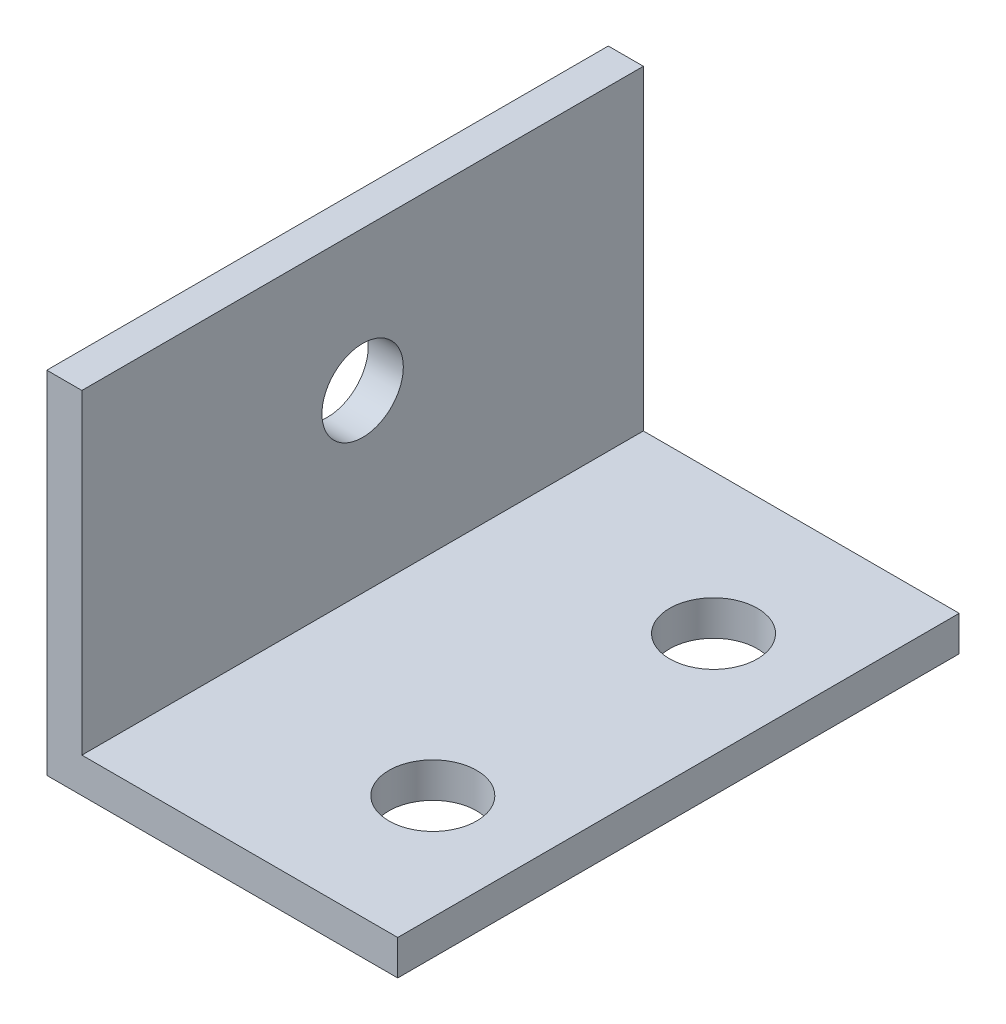
ISO-10303-21;
HEADER;
FILE_DESCRIPTION(('STEP AP214'),'2;1');
FILE_NAME('part.step','',(''),(''),'','','');
FILE_SCHEMA(('AUTOMOTIVE_DESIGN { 1 0 10303 214 1 1 1 1 }'));
ENDSEC;
DATA;
#1=APPLICATION_CONTEXT('core data for automotive mechanical design processes');
#2=APPLICATION_PROTOCOL_DEFINITION('international standard','automotive_design',2000,#1);
#3=PRODUCT_CONTEXT('',#1,'mechanical');
#4=PRODUCT('Part','Part','',(#3));
#5=PRODUCT_RELATED_PRODUCT_CATEGORY('part','',(#4));
#6=PRODUCT_DEFINITION_FORMATION('','',#4);
#7=PRODUCT_DEFINITION_CONTEXT('part definition',#1,'design');
#8=PRODUCT_DEFINITION('design','',#6,#7);
#9=PRODUCT_DEFINITION_SHAPE('','',#8);
#10=(LENGTH_UNIT() NAMED_UNIT(*) SI_UNIT(.MILLI.,.METRE.));
#11=(NAMED_UNIT(*) PLANE_ANGLE_UNIT() SI_UNIT($,.RADIAN.));
#12=(NAMED_UNIT(*) SI_UNIT($,.STERADIAN.) SOLID_ANGLE_UNIT());
#13=UNCERTAINTY_MEASURE_WITH_UNIT(LENGTH_MEASURE(1.E-05),#10,'distance_accuracy_value','');
#14=(GEOMETRIC_REPRESENTATION_CONTEXT(3) GLOBAL_UNCERTAINTY_ASSIGNED_CONTEXT((#13)) GLOBAL_UNIT_ASSIGNED_CONTEXT((#10,
#11,#12)) REPRESENTATION_CONTEXT('',''));
#15=CARTESIAN_POINT('',(0.,0.,0.));
#16=DIRECTION('',(0.,0.,1.));
#17=DIRECTION('',(1.,0.,0.));
#18=AXIS2_PLACEMENT_3D('',#15,#16,#17);
#19=CARTESIAN_POINT('',(0.,0.,50.8));
#20=DIRECTION('',(0.,1.,0.));
#21=DIRECTION('',(0.,0.,1.));
#22=AXIS2_PLACEMENT_3D('',#19,#20,#21);
#23=PLANE('',#22);
#24=CARTESIAN_POINT('',(22.225,0.,12.7));
#25=DIRECTION('',(0.,1.,0.));
#26=DIRECTION('',(0.,0.,1.));
#27=AXIS2_PLACEMENT_3D('',#24,#25,#26);
#28=CIRCLE('',#27,3.96875);
#29=CARTESIAN_POINT('',(22.225,0.,16.66875));
#30=VERTEX_POINT('',#29);
#31=EDGE_CURVE('E164',#30,#30,#28,.F.);
#32=ORIENTED_EDGE('',*,*,#31,.F.);
#33=EDGE_LOOP('',(#32));
#34=FACE_BOUND('',#33,.T.);
#35=CARTESIAN_POINT('',(22.225,0.,38.1));
#36=DIRECTION('',(0.,1.,0.));
#37=DIRECTION('',(0.,0.,1.));
#38=AXIS2_PLACEMENT_3D('',#35,#36,#37);
#39=CIRCLE('',#38,3.96875000000001);
#40=CARTESIAN_POINT('',(22.225,0.,42.06875));
#41=VERTEX_POINT('',#40);
#42=EDGE_CURVE('E167',#41,#41,#39,.F.);
#43=ORIENTED_EDGE('',*,*,#42,.F.);
#44=EDGE_LOOP('',(#43));
#45=FACE_BOUND('',#44,.T.);
#46=DIRECTION('',(1.,0.,0.));
#47=VECTOR('',#46,1.);
#48=CARTESIAN_POINT('',(0.,0.,0.));
#49=LINE('',#48,#47);
#50=CARTESIAN_POINT('',(0.,0.,0.));
#51=VERTEX_POINT('',#50);
#52=CARTESIAN_POINT('',(31.75,0.,0.));
#53=VERTEX_POINT('',#52);
#54=EDGE_CURVE('E119',#51,#53,#49,.T.);
#55=ORIENTED_EDGE('',*,*,#54,.T.);
#56=DIRECTION('',(0.,0.,-1.));
#57=VECTOR('',#56,1.);
#58=CARTESIAN_POINT('',(31.75,0.,50.8));
#59=LINE('',#58,#57);
#60=CARTESIAN_POINT('',(31.75,0.,50.8));
#61=VERTEX_POINT('',#60);
#62=EDGE_CURVE('E11',#61,#53,#59,.T.);
#63=ORIENTED_EDGE('',*,*,#62,.F.);
#64=DIRECTION('',(1.,0.,0.));
#65=VECTOR('',#64,1.);
#66=CARTESIAN_POINT('',(0.,0.,50.8));
#67=LINE('',#66,#65);
#68=CARTESIAN_POINT('',(0.,0.,50.8));
#69=VERTEX_POINT('',#68);
#70=EDGE_CURVE('E134',#69,#61,#67,.T.);
#71=ORIENTED_EDGE('',*,*,#70,.F.);
#72=DIRECTION('',(0.,0.,-1.));
#73=VECTOR('',#72,1.);
#74=CARTESIAN_POINT('',(0.,0.,50.8));
#75=LINE('',#74,#73);
#76=EDGE_CURVE('E51',#69,#51,#75,.T.);
#77=ORIENTED_EDGE('',*,*,#76,.T.);
#78=EDGE_LOOP('',(#55,#63,#71,#77));
#79=FACE_BOUND('',#78,.T.);
#80=ADVANCED_FACE('F35',(#34,#45,#79),#23,.F.);
#81=CARTESIAN_POINT('',(31.75,0.,50.8));
#82=DIRECTION('',(-1.,0.,0.));
#83=DIRECTION('',(0.,0.,1.));
#84=AXIS2_PLACEMENT_3D('',#81,#82,#83);
#85=PLANE('',#84);
#86=DIRECTION('',(0.,1.,0.));
#87=VECTOR('',#86,1.);
#88=CARTESIAN_POINT('',(31.75,0.,0.));
#89=LINE('',#88,#87);
#90=CARTESIAN_POINT('',(31.75,3.175,0.));
#91=VERTEX_POINT('',#90);
#92=EDGE_CURVE('E121',#53,#91,#89,.T.);
#93=ORIENTED_EDGE('',*,*,#92,.T.);
#94=DIRECTION('',(0.,0.,-1.));
#95=VECTOR('',#94,1.);
#96=CARTESIAN_POINT('',(31.75,3.175,50.8));
#97=LINE('',#96,#95);
#98=CARTESIAN_POINT('',(31.75,3.175,50.8));
#99=VERTEX_POINT('',#98);
#100=EDGE_CURVE('E43',#99,#91,#97,.T.);
#101=ORIENTED_EDGE('',*,*,#100,.F.);
#102=DIRECTION('',(0.,1.,0.));
#103=VECTOR('',#102,1.);
#104=CARTESIAN_POINT('',(31.75,0.,50.8));
#105=LINE('',#104,#103);
#106=EDGE_CURVE('E83',#61,#99,#105,.T.);
#107=ORIENTED_EDGE('',*,*,#106,.F.);
#108=ORIENTED_EDGE('',*,*,#62,.T.);
#109=EDGE_LOOP('',(#93,#101,#107,#108));
#110=FACE_BOUND('',#109,.T.);
#111=ADVANCED_FACE('F140',(#110),#85,.F.);
#112=CARTESIAN_POINT('',(0.,3.175,50.8));
#113=DIRECTION('',(0.,1.,0.));
#114=DIRECTION('',(0.,0.,1.));
#115=AXIS2_PLACEMENT_3D('',#112,#113,#114);
#116=PLANE('',#115);
#117=CARTESIAN_POINT('',(22.225,3.175,12.7));
#118=DIRECTION('',(0.,1.,0.));
#119=DIRECTION('',(0.,0.,1.));
#120=AXIS2_PLACEMENT_3D('',#117,#118,#119);
#121=CIRCLE('',#120,3.96875);
#122=CARTESIAN_POINT('',(22.225,3.175,16.66875));
#123=VERTEX_POINT('',#122);
#124=EDGE_CURVE('E180',#123,#123,#121,.T.);
#125=ORIENTED_EDGE('',*,*,#124,.F.);
#126=EDGE_LOOP('',(#125));
#127=FACE_BOUND('',#126,.T.);
#128=CARTESIAN_POINT('',(22.225,3.175,38.1));
#129=DIRECTION('',(0.,1.,0.));
#130=DIRECTION('',(0.,0.,1.));
#131=AXIS2_PLACEMENT_3D('',#128,#129,#130);
#132=CIRCLE('',#131,3.96875000000001);
#133=CARTESIAN_POINT('',(22.225,3.175,42.06875));
#134=VERTEX_POINT('',#133);
#135=EDGE_CURVE('E176',#134,#134,#132,.T.);
#136=ORIENTED_EDGE('',*,*,#135,.F.);
#137=EDGE_LOOP('',(#136));
#138=FACE_BOUND('',#137,.T.);
#139=DIRECTION('',(1.,0.,0.));
#140=VECTOR('',#139,1.);
#141=CARTESIAN_POINT('',(0.,3.175,0.));
#142=LINE('',#141,#140);
#143=CARTESIAN_POINT('',(3.175,3.175,0.));
#144=VERTEX_POINT('',#143);
#145=EDGE_CURVE('E125',#144,#91,#142,.T.);
#146=ORIENTED_EDGE('',*,*,#145,.F.);
#147=DIRECTION('',(0.,0.,-1.));
#148=VECTOR('',#147,1.);
#149=CARTESIAN_POINT('',(3.175,3.175,50.8));
#150=LINE('',#149,#148);
#151=CARTESIAN_POINT('',(3.175,3.175,50.8));
#152=VERTEX_POINT('',#151);
#153=EDGE_CURVE('E111',#152,#144,#150,.T.);
#154=ORIENTED_EDGE('',*,*,#153,.F.);
#155=DIRECTION('',(1.,0.,0.));
#156=VECTOR('',#155,1.);
#157=CARTESIAN_POINT('',(0.,3.175,50.8));
#158=LINE('',#157,#156);
#159=EDGE_CURVE('E101',#152,#99,#158,.T.);
#160=ORIENTED_EDGE('',*,*,#159,.T.);
#161=ORIENTED_EDGE('',*,*,#100,.T.);
#162=EDGE_LOOP('',(#146,#154,#160,#161));
#163=FACE_BOUND('',#162,.T.);
#164=ADVANCED_FACE('F139',(#127,#138,#163),#116,.T.);
#165=CARTESIAN_POINT('',(3.175,0.,50.8));
#166=DIRECTION('',(-1.,0.,0.));
#167=DIRECTION('',(0.,0.,1.));
#168=AXIS2_PLACEMENT_3D('',#165,#166,#167);
#169=PLANE('',#168);
#170=CARTESIAN_POINT('',(3.175,19.05,25.4));
#171=DIRECTION('',(1.,0.,0.));
#172=DIRECTION('',(0.,0.,-1.));
#173=AXIS2_PLACEMENT_3D('',#170,#171,#172);
#174=CIRCLE('',#173,3.683);
#175=CARTESIAN_POINT('',(3.175,19.05,21.717));
#176=VERTEX_POINT('',#175);
#177=EDGE_CURVE('E122',#176,#176,#174,.T.);
#178=ORIENTED_EDGE('',*,*,#177,.F.);
#179=EDGE_LOOP('',(#178));
#180=FACE_BOUND('',#179,.T.);
#181=DIRECTION('',(0.,1.,0.));
#182=VECTOR('',#181,1.);
#183=CARTESIAN_POINT('',(3.175,0.,0.));
#184=LINE('',#183,#182);
#185=CARTESIAN_POINT('',(3.175,31.75,0.));
#186=VERTEX_POINT('',#185);
#187=EDGE_CURVE('E108',#144,#186,#184,.T.);
#188=ORIENTED_EDGE('',*,*,#187,.T.);
#189=DIRECTION('',(0.,0.,-1.));
#190=VECTOR('',#189,1.);
#191=CARTESIAN_POINT('',(3.175,31.75,50.8));
#192=LINE('',#191,#190);
#193=CARTESIAN_POINT('',(3.175,31.75,50.8));
#194=VERTEX_POINT('',#193);
#195=EDGE_CURVE('E105',#194,#186,#192,.T.);
#196=ORIENTED_EDGE('',*,*,#195,.F.);
#197=DIRECTION('',(0.,1.,0.));
#198=VECTOR('',#197,1.);
#199=CARTESIAN_POINT('',(3.175,0.,50.8));
#200=LINE('',#199,#198);
#201=EDGE_CURVE('E94',#152,#194,#200,.T.);
#202=ORIENTED_EDGE('',*,*,#201,.F.);
#203=ORIENTED_EDGE('',*,*,#153,.T.);
#204=EDGE_LOOP('',(#188,#196,#202,#203));
#205=FACE_BOUND('',#204,.T.);
#206=ADVANCED_FACE('F106',(#180,#205),#169,.F.);
#207=CARTESIAN_POINT('',(0.,31.75,50.8));
#208=DIRECTION('',(0.,1.,0.));
#209=DIRECTION('',(0.,0.,1.));
#210=AXIS2_PLACEMENT_3D('',#207,#208,#209);
#211=PLANE('',#210);
#212=DIRECTION('',(1.,0.,0.));
#213=VECTOR('',#212,1.);
#214=CARTESIAN_POINT('',(0.,31.75,0.));
#215=LINE('',#214,#213);
#216=CARTESIAN_POINT('',(0.,31.75,0.));
#217=VERTEX_POINT('',#216);
#218=EDGE_CURVE('E129',#217,#186,#215,.T.);
#219=ORIENTED_EDGE('',*,*,#218,.F.);
#220=DIRECTION('',(0.,0.,-1.));
#221=VECTOR('',#220,1.);
#222=CARTESIAN_POINT('',(0.,31.75,50.8));
#223=LINE('',#222,#221);
#224=CARTESIAN_POINT('',(0.,31.75,50.8));
#225=VERTEX_POINT('',#224);
#226=EDGE_CURVE('E71',#225,#217,#223,.T.);
#227=ORIENTED_EDGE('',*,*,#226,.F.);
#228=DIRECTION('',(1.,0.,0.));
#229=VECTOR('',#228,1.);
#230=CARTESIAN_POINT('',(0.,31.75,50.8));
#231=LINE('',#230,#229);
#232=EDGE_CURVE('E99',#225,#194,#231,.T.);
#233=ORIENTED_EDGE('',*,*,#232,.T.);
#234=ORIENTED_EDGE('',*,*,#195,.T.);
#235=EDGE_LOOP('',(#219,#227,#233,#234));
#236=FACE_BOUND('',#235,.T.);
#237=ADVANCED_FACE('F113',(#236),#211,.T.);
#238=CARTESIAN_POINT('',(0.,0.,50.8));
#239=DIRECTION('',(-1.,0.,0.));
#240=DIRECTION('',(0.,0.,1.));
#241=AXIS2_PLACEMENT_3D('',#238,#239,#240);
#242=PLANE('',#241);
#243=CARTESIAN_POINT('',(0.,19.05,25.4));
#244=DIRECTION('',(-1.,0.,0.));
#245=DIRECTION('',(0.,0.,1.));
#246=AXIS2_PLACEMENT_3D('',#243,#244,#245);
#247=CIRCLE('',#246,3.683);
#248=CARTESIAN_POINT('',(0.,19.05,29.083));
#249=VERTEX_POINT('',#248);
#250=EDGE_CURVE('E171',#249,#249,#247,.F.);
#251=ORIENTED_EDGE('',*,*,#250,.T.);
#252=EDGE_LOOP('',(#251));
#253=FACE_BOUND('',#252,.T.);
#254=DIRECTION('',(0.,1.,0.));
#255=VECTOR('',#254,1.);
#256=CARTESIAN_POINT('',(0.,0.,0.));
#257=LINE('',#256,#255);
#258=EDGE_CURVE('E131',#51,#217,#257,.T.);
#259=ORIENTED_EDGE('',*,*,#258,.F.);
#260=ORIENTED_EDGE('',*,*,#76,.F.);
#261=DIRECTION('',(0.,1.,0.));
#262=VECTOR('',#261,1.);
#263=CARTESIAN_POINT('',(0.,0.,50.8));
#264=LINE('',#263,#262);
#265=EDGE_CURVE('E114',#69,#225,#264,.T.);
#266=ORIENTED_EDGE('',*,*,#265,.T.);
#267=ORIENTED_EDGE('',*,*,#226,.T.);
#268=EDGE_LOOP('',(#259,#260,#266,#267));
#269=FACE_BOUND('',#268,.T.);
#270=ADVANCED_FACE('F144',(#253,#269),#242,.T.);
#271=CARTESIAN_POINT('',(0.,0.,50.8));
#272=DIRECTION('',(0.,0.,1.));
#273=DIRECTION('',(1.,0.,0.));
#274=AXIS2_PLACEMENT_3D('',#271,#272,#273);
#275=PLANE('',#274);
#276=ORIENTED_EDGE('',*,*,#70,.T.);
#277=ORIENTED_EDGE('',*,*,#106,.T.);
#278=ORIENTED_EDGE('',*,*,#159,.F.);
#279=ORIENTED_EDGE('',*,*,#201,.T.);
#280=ORIENTED_EDGE('',*,*,#232,.F.);
#281=ORIENTED_EDGE('',*,*,#265,.F.);
#282=EDGE_LOOP('',(#276,#277,#278,#279,#280,#281));
#283=FACE_BOUND('',#282,.T.);
#284=ADVANCED_FACE('F96',(#283),#275,.T.);
#285=CARTESIAN_POINT('',(0.,0.,0.));
#286=DIRECTION('',(0.,0.,1.));
#287=DIRECTION('',(1.,0.,0.));
#288=AXIS2_PLACEMENT_3D('',#285,#286,#287);
#289=PLANE('',#288);
#290=ORIENTED_EDGE('',*,*,#54,.F.);
#291=ORIENTED_EDGE('',*,*,#258,.T.);
#292=ORIENTED_EDGE('',*,*,#218,.T.);
#293=ORIENTED_EDGE('',*,*,#187,.F.);
#294=ORIENTED_EDGE('',*,*,#145,.T.);
#295=ORIENTED_EDGE('',*,*,#92,.F.);
#296=EDGE_LOOP('',(#290,#291,#292,#293,#294,#295));
#297=FACE_BOUND('',#296,.T.);
#298=ADVANCED_FACE('F143',(#297),#289,.F.);
#299=CARTESIAN_POINT('',(-0.00100000000000013,19.05,25.4));
#300=DIRECTION('',(1.,0.,0.));
#301=DIRECTION('',(0.,0.,-1.));
#302=AXIS2_PLACEMENT_3D('',#299,#300,#301);
#303=CYLINDRICAL_SURFACE('',#302,3.683);
#304=ORIENTED_EDGE('',*,*,#250,.F.);
#305=EDGE_LOOP('',(#304));
#306=FACE_BOUND('',#305,.T.);
#307=ORIENTED_EDGE('',*,*,#177,.T.);
#308=EDGE_LOOP('',(#307));
#309=FACE_BOUND('',#308,.T.);
#310=ADVANCED_FACE('F195',(#306,#309),#303,.F.);
#311=CARTESIAN_POINT('',(22.225,-0.00100000000000013,38.1));
#312=DIRECTION('',(0.,1.,0.));
#313=DIRECTION('',(0.,0.,1.));
#314=AXIS2_PLACEMENT_3D('',#311,#312,#313);
#315=CYLINDRICAL_SURFACE('',#314,3.96875000000001);
#316=ORIENTED_EDGE('',*,*,#135,.T.);
#317=EDGE_LOOP('',(#316));
#318=FACE_BOUND('',#317,.T.);
#319=ORIENTED_EDGE('',*,*,#42,.T.);
#320=EDGE_LOOP('',(#319));
#321=FACE_BOUND('',#320,.T.);
#322=ADVANCED_FACE('F192',(#318,#321),#315,.F.);
#323=CARTESIAN_POINT('',(22.225,-0.00100000000000013,12.7));
#324=DIRECTION('',(0.,1.,0.));
#325=DIRECTION('',(0.,0.,1.));
#326=AXIS2_PLACEMENT_3D('',#323,#324,#325);
#327=CYLINDRICAL_SURFACE('',#326,3.96875);
#328=ORIENTED_EDGE('',*,*,#124,.T.);
#329=EDGE_LOOP('',(#328));
#330=FACE_BOUND('',#329,.T.);
#331=ORIENTED_EDGE('',*,*,#31,.T.);
#332=EDGE_LOOP('',(#331));
#333=FACE_BOUND('',#332,.T.);
#334=ADVANCED_FACE('F184',(#330,#333),#327,.F.);
#335=CLOSED_SHELL('',(#80,#111,#164,#206,#237,#270,#284,#298,#310,#322,#334));
#336=MANIFOLD_SOLID_BREP('B2',#335);
#337=ADVANCED_BREP_SHAPE_REPRESENTATION('',(#18,#336),#14);
#338=SHAPE_DEFINITION_REPRESENTATION(#9,#337);
ENDSEC;
END-ISO-10303-21;
